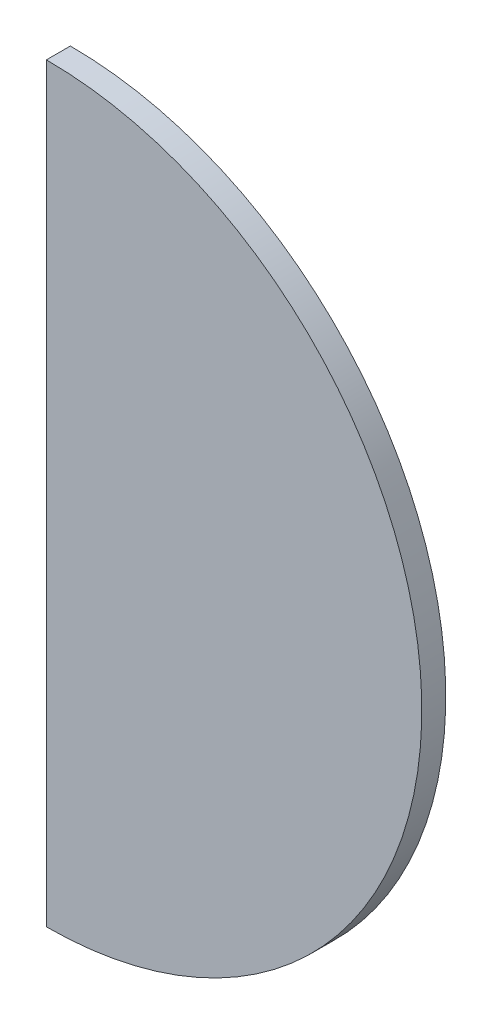
ISO-10303-21;
HEADER;
FILE_DESCRIPTION(('STEP AP214'),'2;1');
FILE_NAME('part.step','',(''),(''),'','','');
FILE_SCHEMA(('AUTOMOTIVE_DESIGN { 1 0 10303 214 1 1 1 1 }'));
ENDSEC;
DATA;
#1=APPLICATION_CONTEXT('core data for automotive mechanical design processes');
#2=APPLICATION_PROTOCOL_DEFINITION('international standard','automotive_design',2000,#1);
#3=PRODUCT_CONTEXT('',#1,'mechanical');
#4=PRODUCT('Part','Part','',(#3));
#5=PRODUCT_RELATED_PRODUCT_CATEGORY('part','',(#4));
#6=PRODUCT_DEFINITION_FORMATION('','',#4);
#7=PRODUCT_DEFINITION_CONTEXT('part definition',#1,'design');
#8=PRODUCT_DEFINITION('design','',#6,#7);
#9=PRODUCT_DEFINITION_SHAPE('','',#8);
#10=(LENGTH_UNIT() NAMED_UNIT(*) SI_UNIT(.MILLI.,.METRE.));
#11=(NAMED_UNIT(*) PLANE_ANGLE_UNIT() SI_UNIT($,.RADIAN.));
#12=(NAMED_UNIT(*) SI_UNIT($,.STERADIAN.) SOLID_ANGLE_UNIT());
#13=UNCERTAINTY_MEASURE_WITH_UNIT(LENGTH_MEASURE(1.E-05),#10,'distance_accuracy_value','');
#14=(GEOMETRIC_REPRESENTATION_CONTEXT(3) GLOBAL_UNCERTAINTY_ASSIGNED_CONTEXT((#13)) GLOBAL_UNIT_ASSIGNED_CONTEXT((#10,
#11,#12)) REPRESENTATION_CONTEXT('',''));
#15=CARTESIAN_POINT('',(0.,0.,0.));
#16=DIRECTION('',(0.,0.,1.));
#17=DIRECTION('',(1.,0.,0.));
#18=AXIS2_PLACEMENT_3D('',#15,#16,#17);
#19=CARTESIAN_POINT('',(300.,1.71683972880179E-13,0.));
#20=DIRECTION('',(-1.,0.,0.));
#21=DIRECTION('',(0.,-1.,0.));
#22=AXIS2_PLACEMENT_3D('',#19,#20,#21);
#23=PLANE('',#22);
#24=DIRECTION('',(0.,0.,-1.));
#25=VECTOR('',#24,1.);
#26=CARTESIAN_POINT('',(300.,47.,60.01));
#27=LINE('',#26,#25);
#28=CARTESIAN_POINT('',(300.,47.,3.));
#29=VERTEX_POINT('',#28);
#30=CARTESIAN_POINT('',(300.,47.,0.));
#31=VERTEX_POINT('',#30);
#32=EDGE_CURVE('E62',#29,#31,#27,.T.);
#33=ORIENTED_EDGE('',*,*,#32,.T.);
#34=DIRECTION('',(0.,-1.,0.));
#35=VECTOR('',#34,1.);
#36=CARTESIAN_POINT('',(300.,3.43367945760358E-13,0.));
#37=LINE('',#36,#35);
#38=CARTESIAN_POINT('',(300.,-47.,0.));
#39=VERTEX_POINT('',#38);
#40=EDGE_CURVE('E64',#31,#39,#37,.T.);
#41=ORIENTED_EDGE('',*,*,#40,.T.);
#42=DIRECTION('',(0.,0.,-1.));
#43=VECTOR('',#42,1.);
#44=CARTESIAN_POINT('',(300.,-47.,60.01));
#45=LINE('',#44,#43);
#46=CARTESIAN_POINT('',(300.,-47.,3.));
#47=VERTEX_POINT('',#46);
#48=EDGE_CURVE('E36',#47,#39,#45,.T.);
#49=ORIENTED_EDGE('',*,*,#48,.F.);
#50=DIRECTION('',(0.,-1.,0.));
#51=VECTOR('',#50,1.);
#52=CARTESIAN_POINT('',(300.,3.43367945760358E-13,3.));
#53=LINE('',#52,#51);
#54=EDGE_CURVE('E65',#29,#47,#53,.T.);
#55=ORIENTED_EDGE('',*,*,#54,.F.);
#56=EDGE_LOOP('',(#33,#41,#49,#55));
#57=FACE_BOUND('',#56,.T.);
#58=ADVANCED_FACE('F32',(#57),#23,.T.);
#59=CARTESIAN_POINT('',(-300.,0.,0.));
#60=DIRECTION('',(0.,0.,1.));
#61=DIRECTION('',(1.,0.,0.));
#62=AXIS2_PLACEMENT_3D('',#59,#60,#61);
#63=PLANE('',#62);
#64=ORIENTED_EDGE('',*,*,#40,.F.);
#65=CARTESIAN_POINT('',(300.,0.,0.));
#66=DIRECTION('',(0.,0.,-1.));
#67=DIRECTION('',(-1.,0.,0.));
#68=AXIS2_PLACEMENT_3D('',#65,#66,#67);
#69=CIRCLE('',#68,47.);
#70=EDGE_CURVE('E11',#31,#39,#69,.T.);
#71=ORIENTED_EDGE('',*,*,#70,.T.);
#72=EDGE_LOOP('',(#64,#71));
#73=FACE_BOUND('',#72,.T.);
#74=ADVANCED_FACE('F34',(#73),#63,.F.);
#75=CARTESIAN_POINT('',(-300.,0.,3.));
#76=DIRECTION('',(0.,0.,1.));
#77=DIRECTION('',(1.,0.,0.));
#78=AXIS2_PLACEMENT_3D('',#75,#76,#77);
#79=PLANE('',#78);
#80=CARTESIAN_POINT('',(300.,0.,3.));
#81=DIRECTION('',(0.,0.,1.));
#82=DIRECTION('',(1.,0.,0.));
#83=AXIS2_PLACEMENT_3D('',#80,#81,#82);
#84=CIRCLE('',#83,47.);
#85=EDGE_CURVE('E41',#47,#29,#84,.T.);
#86=ORIENTED_EDGE('',*,*,#85,.T.);
#87=ORIENTED_EDGE('',*,*,#54,.T.);
#88=EDGE_LOOP('',(#86,#87));
#89=FACE_BOUND('',#88,.T.);
#90=ADVANCED_FACE('F70',(#89),#79,.T.);
#91=CARTESIAN_POINT('',(300.,0.,60.01));
#92=DIRECTION('',(0.,0.,-1.));
#93=DIRECTION('',(-1.,0.,0.));
#94=AXIS2_PLACEMENT_3D('',#91,#92,#93);
#95=CYLINDRICAL_SURFACE('',#94,47.);
#96=ORIENTED_EDGE('',*,*,#85,.F.);
#97=ORIENTED_EDGE('',*,*,#48,.T.);
#98=ORIENTED_EDGE('',*,*,#70,.F.);
#99=ORIENTED_EDGE('',*,*,#32,.F.);
#100=EDGE_LOOP('',(#96,#97,#98,#99));
#101=FACE_BOUND('',#100,.T.);
#102=ADVANCED_FACE('F60',(#101),#95,.T.);
#103=CLOSED_SHELL('',(#58,#74,#90,#102));
#104=MANIFOLD_SOLID_BREP('B2',#103);
#105=ADVANCED_BREP_SHAPE_REPRESENTATION('',(#18,#104),#14);
#106=SHAPE_DEFINITION_REPRESENTATION(#9,#105);
ENDSEC;
END-ISO-10303-21;
